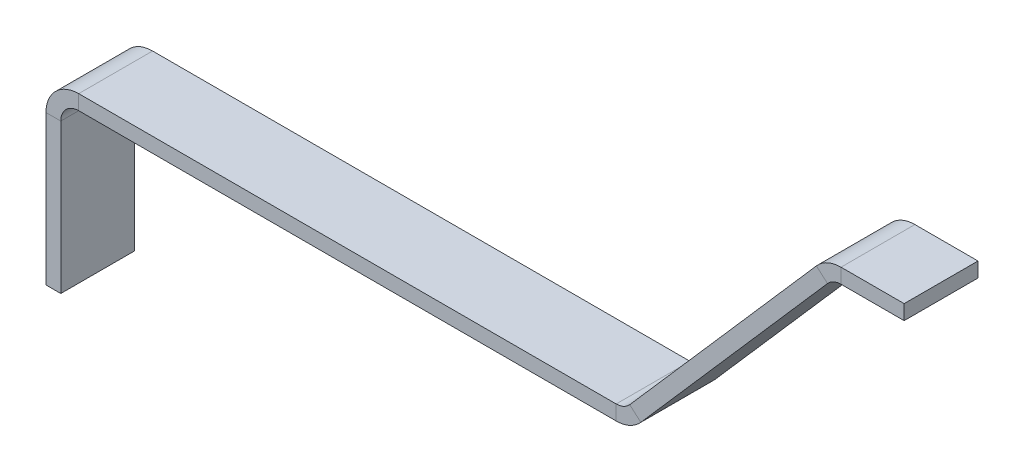
ISO-10303-21;
HEADER;
FILE_DESCRIPTION(('STEP AP214'),'2;1');
FILE_NAME('part.step','',(''),(''),'','','');
FILE_SCHEMA(('AUTOMOTIVE_DESIGN { 1 0 10303 214 1 1 1 1 }'));
ENDSEC;
DATA;
#1=APPLICATION_CONTEXT('core data for automotive mechanical design processes');
#2=APPLICATION_PROTOCOL_DEFINITION('international standard','automotive_design',2000,#1);
#3=PRODUCT_CONTEXT('',#1,'mechanical');
#4=PRODUCT('Part','Part','',(#3));
#5=PRODUCT_RELATED_PRODUCT_CATEGORY('part','',(#4));
#6=PRODUCT_DEFINITION_FORMATION('','',#4);
#7=PRODUCT_DEFINITION_CONTEXT('part definition',#1,'design');
#8=PRODUCT_DEFINITION('design','',#6,#7);
#9=PRODUCT_DEFINITION_SHAPE('','',#8);
#10=(LENGTH_UNIT() NAMED_UNIT(*) SI_UNIT(.MILLI.,.METRE.));
#11=(NAMED_UNIT(*) PLANE_ANGLE_UNIT() SI_UNIT($,.RADIAN.));
#12=(NAMED_UNIT(*) SI_UNIT($,.STERADIAN.) SOLID_ANGLE_UNIT());
#13=UNCERTAINTY_MEASURE_WITH_UNIT(LENGTH_MEASURE(1.E-05),#10,'distance_accuracy_value','');
#14=(GEOMETRIC_REPRESENTATION_CONTEXT(3) GLOBAL_UNCERTAINTY_ASSIGNED_CONTEXT((#13)) GLOBAL_UNIT_ASSIGNED_CONTEXT((#10,
#11,#12)) REPRESENTATION_CONTEXT('',''));
#15=CARTESIAN_POINT('',(0.,0.,0.));
#16=DIRECTION('',(0.,0.,1.));
#17=DIRECTION('',(1.,0.,0.));
#18=AXIS2_PLACEMENT_3D('',#15,#16,#17);
#19=CARTESIAN_POINT('',(-78.294437183355,-24.6505896738829,10.));
#20=DIRECTION('',(0.,-1.,0.));
#21=DIRECTION('',(0.,0.,-1.));
#22=AXIS2_PLACEMENT_3D('',#19,#20,#21);
#23=PLANE('',#22);
#24=DIRECTION('',(-1.,0.,0.));
#25=VECTOR('',#24,1.);
#26=CARTESIAN_POINT('',(-78.294437183355,-24.6505896738829,0.));
#27=LINE('',#26,#25);
#28=CARTESIAN_POINT('',(-76.294437183355,-24.6505896738829,0.));
#29=VERTEX_POINT('',#28);
#30=CARTESIAN_POINT('',(-78.294437183355,-24.6505896738829,0.));
#31=VERTEX_POINT('',#30);
#32=EDGE_CURVE('E11',#29,#31,#27,.T.);
#33=ORIENTED_EDGE('',*,*,#32,.F.);
#34=DIRECTION('',(0.,0.,-1.));
#35=VECTOR('',#34,1.);
#36=CARTESIAN_POINT('',(-76.294437183355,-24.6505896738829,10.));
#37=LINE('',#36,#35);
#38=CARTESIAN_POINT('',(-76.294437183355,-24.6505896738829,10.));
#39=VERTEX_POINT('',#38);
#40=EDGE_CURVE('E110',#39,#29,#37,.T.);
#41=ORIENTED_EDGE('',*,*,#40,.F.);
#42=DIRECTION('',(-1.,0.,0.));
#43=VECTOR('',#42,1.);
#44=CARTESIAN_POINT('',(-78.294437183355,-24.6505896738829,10.));
#45=LINE('',#44,#43);
#46=CARTESIAN_POINT('',(-78.294437183355,-24.6505896738829,10.));
#47=VERTEX_POINT('',#46);
#48=EDGE_CURVE('E47',#39,#47,#45,.T.);
#49=ORIENTED_EDGE('',*,*,#48,.T.);
#50=DIRECTION('',(0.,0.,-1.));
#51=VECTOR('',#50,1.);
#52=CARTESIAN_POINT('',(-78.294437183355,-24.6505896738829,10.));
#53=LINE('',#52,#51);
#54=EDGE_CURVE('E113',#47,#31,#53,.T.);
#55=ORIENTED_EDGE('',*,*,#54,.T.);
#56=EDGE_LOOP('',(#33,#41,#49,#55));
#57=FACE_BOUND('',#56,.T.);
#58=ADVANCED_FACE('F37',(#57),#23,.T.);
#59=CARTESIAN_POINT('',(-78.294437183355,-24.6505896738829,10.));
#60=DIRECTION('',(0.,0.,1.));
#61=DIRECTION('',(0.,-1.,0.));
#62=AXIS2_PLACEMENT_3D('',#59,#60,#61);
#63=PLANE('',#62);
#64=ORIENTED_EDGE('',*,*,#48,.F.);
#65=DIRECTION('',(0.,1.,0.));
#66=VECTOR('',#65,1.);
#67=CARTESIAN_POINT('',(-76.294437183355,-24.6505896738829,10.));
#68=LINE('',#67,#66);
#69=CARTESIAN_POINT('',(-76.294437183355,-4.43,10.));
#70=VERTEX_POINT('',#69);
#71=EDGE_CURVE('E126',#70,#39,#68,.F.);
#72=ORIENTED_EDGE('',*,*,#71,.F.);
#73=DIRECTION('',(-1.,0.,0.));
#74=VECTOR('',#73,1.);
#75=CARTESIAN_POINT('',(-78.294437183355,-4.43,10.));
#76=LINE('',#75,#74);
#77=CARTESIAN_POINT('',(-78.294437183355,-4.43,10.));
#78=VERTEX_POINT('',#77);
#79=EDGE_CURVE('E171',#70,#78,#76,.T.);
#80=ORIENTED_EDGE('',*,*,#79,.T.);
#81=DIRECTION('',(0.,-1.,0.));
#82=VECTOR('',#81,1.);
#83=CARTESIAN_POINT('',(-78.294437183355,-24.6505896738829,10.));
#84=LINE('',#83,#82);
#85=EDGE_CURVE('E183',#78,#47,#84,.T.);
#86=ORIENTED_EDGE('',*,*,#85,.T.);
#87=EDGE_LOOP('',(#64,#72,#80,#86));
#88=FACE_BOUND('',#87,.T.);
#89=ADVANCED_FACE('F187',(#88),#63,.T.);
#90=CARTESIAN_POINT('',(-73.8644371833551,-4.43,10.));
#91=DIRECTION('',(0.,0.,-1.));
#92=DIRECTION('',(-1.,0.,0.));
#93=AXIS2_PLACEMENT_3D('',#90,#91,#92);
#94=PLANE('',#93);
#95=ORIENTED_EDGE('',*,*,#79,.F.);
#96=CARTESIAN_POINT('',(-73.8644371833551,-4.43,10.));
#97=DIRECTION('',(0.,0.,-1.));
#98=DIRECTION('',(-1.,0.,0.));
#99=AXIS2_PLACEMENT_3D('',#96,#97,#98);
#100=CIRCLE('',#99,2.43);
#101=CARTESIAN_POINT('',(-73.8644371833551,-2.,10.));
#102=VERTEX_POINT('',#101);
#103=EDGE_CURVE('E222',#102,#70,#100,.F.);
#104=ORIENTED_EDGE('',*,*,#103,.F.);
#105=DIRECTION('',(0.,1.,0.));
#106=VECTOR('',#105,1.);
#107=CARTESIAN_POINT('',(-73.8644371833551,0.,10.));
#108=LINE('',#107,#106);
#109=CARTESIAN_POINT('',(-73.8644371833551,0.,10.));
#110=VERTEX_POINT('',#109);
#111=EDGE_CURVE('E168',#102,#110,#108,.T.);
#112=ORIENTED_EDGE('',*,*,#111,.T.);
#113=CARTESIAN_POINT('',(-73.8644371833551,-4.43,10.));
#114=DIRECTION('',(0.,0.,1.));
#115=DIRECTION('',(1.,0.,0.));
#116=AXIS2_PLACEMENT_3D('',#113,#114,#115);
#117=CIRCLE('',#116,4.43);
#118=EDGE_CURVE('E196',#110,#78,#117,.T.);
#119=ORIENTED_EDGE('',*,*,#118,.T.);
#120=EDGE_LOOP('',(#95,#104,#112,#119));
#121=FACE_BOUND('',#120,.T.);
#122=ADVANCED_FACE('F265',(#121),#94,.F.);
#123=CARTESIAN_POINT('',(-73.8644371833551,0.,10.));
#124=DIRECTION('',(0.,0.,1.));
#125=DIRECTION('',(-1.,0.,0.));
#126=AXIS2_PLACEMENT_3D('',#123,#124,#125);
#127=PLANE('',#126);
#128=ORIENTED_EDGE('',*,*,#111,.F.);
#129=DIRECTION('',(1.,0.,0.));
#130=VECTOR('',#129,1.);
#131=CARTESIAN_POINT('',(-73.8644371833551,-2.,10.));
#132=LINE('',#131,#130);
#133=CARTESIAN_POINT('',(-1.10327028692001,-2.,10.));
#134=VERTEX_POINT('',#133);
#135=EDGE_CURVE('E217',#134,#102,#132,.F.);
#136=ORIENTED_EDGE('',*,*,#135,.F.);
#137=DIRECTION('',(0.,1.,0.));
#138=VECTOR('',#137,1.);
#139=CARTESIAN_POINT('',(-1.10327028692001,0.,10.));
#140=LINE('',#139,#138);
#141=CARTESIAN_POINT('',(-1.10327028692001,0.,10.));
#142=VERTEX_POINT('',#141);
#143=EDGE_CURVE('E165',#134,#142,#140,.T.);
#144=ORIENTED_EDGE('',*,*,#143,.T.);
#145=DIRECTION('',(-1.,0.,0.));
#146=VECTOR('',#145,1.);
#147=CARTESIAN_POINT('',(-73.8644371833551,0.,10.));
#148=LINE('',#147,#146);
#149=EDGE_CURVE('E285',#142,#110,#148,.T.);
#150=ORIENTED_EDGE('',*,*,#149,.T.);
#151=EDGE_LOOP('',(#128,#136,#144,#150));
#152=FACE_BOUND('',#151,.T.);
#153=ADVANCED_FACE('F284',(#152),#127,.T.);
#154=CARTESIAN_POINT('',(-1.10327028692001,2.43,10.));
#155=DIRECTION('',(0.,0.,1.));
#156=DIRECTION('',(1.,0.,0.));
#157=AXIS2_PLACEMENT_3D('',#154,#155,#156);
#158=PLANE('',#157);
#159=ORIENTED_EDGE('',*,*,#143,.F.);
#160=CARTESIAN_POINT('',(-1.10327028692001,2.43,10.));
#161=DIRECTION('',(0.,0.,1.));
#162=DIRECTION('',(1.,0.,0.));
#163=AXIS2_PLACEMENT_3D('',#160,#161,#162);
#164=CIRCLE('',#163,4.43);
#165=CARTESIAN_POINT('',(2.23186553824323,-0.485779317388882,10.));
#166=VERTEX_POINT('',#165);
#167=EDGE_CURVE('E237',#134,#166,#164,.T.);
#168=ORIENTED_EDGE('',*,*,#167,.T.);
#169=DIRECTION('',(-0.752852330736621,0.658189462164534,0.));
#170=VECTOR('',#169,1.);
#171=CARTESIAN_POINT('',(0.726160876769985,0.830599606940182,10.));
#172=LINE('',#171,#170);
#173=CARTESIAN_POINT('',(0.726160876769985,0.830599606940182,10.));
#174=VERTEX_POINT('',#173);
#175=EDGE_CURVE('E55',#166,#174,#172,.T.);
#176=ORIENTED_EDGE('',*,*,#175,.T.);
#177=CARTESIAN_POINT('',(-1.10327028692001,2.43,10.));
#178=DIRECTION('',(0.,0.,-1.));
#179=DIRECTION('',(-1.,0.,0.));
#180=AXIS2_PLACEMENT_3D('',#177,#178,#179);
#181=CIRCLE('',#180,2.43);
#182=EDGE_CURVE('E207',#142,#174,#181,.F.);
#183=ORIENTED_EDGE('',*,*,#182,.F.);
#184=EDGE_LOOP('',(#159,#168,#176,#183));
#185=FACE_BOUND('',#184,.T.);
#186=ADVANCED_FACE('F294',(#185),#158,.T.);
#187=CARTESIAN_POINT('',(0.,0.,10.));
#188=DIRECTION('',(0.,0.,1.));
#189=DIRECTION('',(-0.658189462164534,-0.752852330736621,0.));
#190=AXIS2_PLACEMENT_3D('',#187,#188,#189);
#191=PLANE('',#190);
#192=ORIENTED_EDGE('',*,*,#175,.F.);
#193=DIRECTION('',(0.658189462164534,0.752852330736621,0.));
#194=VECTOR('',#193,1.);
#195=CARTESIAN_POINT('',(1.50570466147324,-1.31637892432907,10.));
#196=LINE('',#195,#194);
#197=CARTESIAN_POINT('',(27.5050899171433,28.4223192965147,10.));
#198=VERTEX_POINT('',#197);
#199=EDGE_CURVE('E229',#198,#166,#196,.F.);
#200=ORIENTED_EDGE('',*,*,#199,.F.);
#201=DIRECTION('',(-0.752852330736625,0.658189462164529,0.));
#202=VECTOR('',#201,1.);
#203=CARTESIAN_POINT('',(25.9993852556701,29.7386982208438,10.));
#204=LINE('',#203,#202);
#205=CARTESIAN_POINT('',(25.9993852556701,29.7386982208438,10.));
#206=VERTEX_POINT('',#205);
#207=EDGE_CURVE('E161',#198,#206,#204,.T.);
#208=ORIENTED_EDGE('',*,*,#207,.T.);
#209=DIRECTION('',(-0.658189462164534,-0.752852330736621,0.));
#210=VECTOR('',#209,1.);
#211=CARTESIAN_POINT('',(0.,0.,10.));
#212=LINE('',#211,#210);
#213=EDGE_CURVE('E309',#206,#174,#212,.T.);
#214=ORIENTED_EDGE('',*,*,#213,.T.);
#215=EDGE_LOOP('',(#192,#200,#208,#214));
#216=FACE_BOUND('',#215,.T.);
#217=ADVANCED_FACE('F416',(#216),#191,.T.);
#218=CARTESIAN_POINT('',(29.3345210808333,26.8229189034549,10.));
#219=DIRECTION('',(0.,0.,-1.));
#220=DIRECTION('',(-1.,0.,0.));
#221=AXIS2_PLACEMENT_3D('',#218,#219,#220);
#222=PLANE('',#221);
#223=ORIENTED_EDGE('',*,*,#207,.F.);
#224=CARTESIAN_POINT('',(29.3345210808333,26.8229189034549,10.));
#225=DIRECTION('',(0.,0.,-1.));
#226=DIRECTION('',(-1.,0.,0.));
#227=AXIS2_PLACEMENT_3D('',#224,#225,#226);
#228=CIRCLE('',#227,2.43);
#229=CARTESIAN_POINT('',(29.3345210808333,29.2529189034549,10.));
#230=VERTEX_POINT('',#229);
#231=EDGE_CURVE('E131',#230,#198,#228,.F.);
#232=ORIENTED_EDGE('',*,*,#231,.F.);
#233=DIRECTION('',(0.,1.,0.));
#234=VECTOR('',#233,1.);
#235=CARTESIAN_POINT('',(29.3345210808333,31.2529189034549,10.));
#236=LINE('',#235,#234);
#237=CARTESIAN_POINT('',(29.3345210808333,31.2529189034549,10.));
#238=VERTEX_POINT('',#237);
#239=EDGE_CURVE('E158',#230,#238,#236,.T.);
#240=ORIENTED_EDGE('',*,*,#239,.T.);
#241=CARTESIAN_POINT('',(29.3345210808333,26.8229189034549,10.));
#242=DIRECTION('',(0.,0.,1.));
#243=DIRECTION('',(1.,0.,0.));
#244=AXIS2_PLACEMENT_3D('',#241,#242,#243);
#245=CIRCLE('',#244,4.43);
#246=EDGE_CURVE('E329',#238,#206,#245,.T.);
#247=ORIENTED_EDGE('',*,*,#246,.T.);
#248=EDGE_LOOP('',(#223,#232,#240,#247));
#249=FACE_BOUND('',#248,.T.);
#250=ADVANCED_FACE('F335',(#249),#222,.F.);
#251=CARTESIAN_POINT('',(29.3345210808333,31.2529189034549,10.));
#252=DIRECTION('',(0.,0.,1.));
#253=DIRECTION('',(-1.,0.,0.));
#254=AXIS2_PLACEMENT_3D('',#251,#252,#253);
#255=PLANE('',#254);
#256=ORIENTED_EDGE('',*,*,#239,.F.);
#257=DIRECTION('',(1.,0.,0.));
#258=VECTOR('',#257,1.);
#259=CARTESIAN_POINT('',(29.3345210808333,29.2529189034549,10.));
#260=LINE('',#259,#258);
#261=CARTESIAN_POINT('',(37.877386656703,29.2529189034549,10.));
#262=VERTEX_POINT('',#261);
#263=EDGE_CURVE('E233',#262,#230,#260,.F.);
#264=ORIENTED_EDGE('',*,*,#263,.F.);
#265=DIRECTION('',(0.,1.,0.));
#266=VECTOR('',#265,1.);
#267=CARTESIAN_POINT('',(37.877386656703,31.2529189034549,10.));
#268=LINE('',#267,#266);
#269=CARTESIAN_POINT('',(37.877386656703,31.2529189034549,10.));
#270=VERTEX_POINT('',#269);
#271=EDGE_CURVE('E155',#262,#270,#268,.T.);
#272=ORIENTED_EDGE('',*,*,#271,.T.);
#273=DIRECTION('',(-1.,0.,0.));
#274=VECTOR('',#273,1.);
#275=CARTESIAN_POINT('',(29.3345210808333,31.2529189034549,10.));
#276=LINE('',#275,#274);
#277=EDGE_CURVE('E320',#270,#238,#276,.T.);
#278=ORIENTED_EDGE('',*,*,#277,.T.);
#279=EDGE_LOOP('',(#256,#264,#272,#278));
#280=FACE_BOUND('',#279,.T.);
#281=ADVANCED_FACE('F422',(#280),#255,.T.);
#282=CARTESIAN_POINT('',(37.877386656703,31.2529189034549,10.));
#283=DIRECTION('',(-1.,0.,0.));
#284=DIRECTION('',(0.,0.,-1.));
#285=AXIS2_PLACEMENT_3D('',#282,#283,#284);
#286=PLANE('',#285);
#287=ORIENTED_EDGE('',*,*,#271,.F.);
#288=DIRECTION('',(0.,0.,-1.));
#289=VECTOR('',#288,1.);
#290=CARTESIAN_POINT('',(37.877386656703,29.2529189034549,10.));
#291=LINE('',#290,#289);
#292=CARTESIAN_POINT('',(37.877386656703,29.2529189034549,0.));
#293=VERTEX_POINT('',#292);
#294=EDGE_CURVE('E246',#262,#293,#291,.T.);
#295=ORIENTED_EDGE('',*,*,#294,.T.);
#296=DIRECTION('',(0.,1.,0.));
#297=VECTOR('',#296,1.);
#298=CARTESIAN_POINT('',(37.877386656703,31.2529189034549,0.));
#299=LINE('',#298,#297);
#300=CARTESIAN_POINT('',(37.877386656703,31.2529189034549,0.));
#301=VERTEX_POINT('',#300);
#302=EDGE_CURVE('E152',#293,#301,#299,.T.);
#303=ORIENTED_EDGE('',*,*,#302,.T.);
#304=DIRECTION('',(0.,0.,-1.));
#305=VECTOR('',#304,1.);
#306=CARTESIAN_POINT('',(37.877386656703,31.2529189034549,10.));
#307=LINE('',#306,#305);
#308=EDGE_CURVE('E323',#270,#301,#307,.T.);
#309=ORIENTED_EDGE('',*,*,#308,.F.);
#310=EDGE_LOOP('',(#287,#295,#303,#309));
#311=FACE_BOUND('',#310,.T.);
#312=ADVANCED_FACE('F361',(#311),#286,.F.);
#313=CARTESIAN_POINT('',(29.3345210808333,31.2529189034549,0.));
#314=DIRECTION('',(0.,0.,1.));
#315=DIRECTION('',(-1.,0.,0.));
#316=AXIS2_PLACEMENT_3D('',#313,#314,#315);
#317=PLANE('',#316);
#318=ORIENTED_EDGE('',*,*,#302,.F.);
#319=DIRECTION('',(1.,0.,0.));
#320=VECTOR('',#319,1.);
#321=CARTESIAN_POINT('',(29.3345210808333,29.2529189034549,0.));
#322=LINE('',#321,#320);
#323=CARTESIAN_POINT('',(29.3345210808333,29.2529189034549,0.));
#324=VERTEX_POINT('',#323);
#325=EDGE_CURVE('E228',#293,#324,#322,.F.);
#326=ORIENTED_EDGE('',*,*,#325,.T.);
#327=DIRECTION('',(0.,1.,0.));
#328=VECTOR('',#327,1.);
#329=CARTESIAN_POINT('',(29.3345210808333,31.2529189034549,0.));
#330=LINE('',#329,#328);
#331=CARTESIAN_POINT('',(29.3345210808333,31.2529189034549,0.));
#332=VERTEX_POINT('',#331);
#333=EDGE_CURVE('E149',#324,#332,#330,.T.);
#334=ORIENTED_EDGE('',*,*,#333,.T.);
#335=DIRECTION('',(-1.,0.,0.));
#336=VECTOR('',#335,1.);
#337=CARTESIAN_POINT('',(29.3345210808333,31.2529189034549,0.));
#338=LINE('',#337,#336);
#339=EDGE_CURVE('E314',#301,#332,#338,.T.);
#340=ORIENTED_EDGE('',*,*,#339,.F.);
#341=EDGE_LOOP('',(#318,#326,#334,#340));
#342=FACE_BOUND('',#341,.T.);
#343=ADVANCED_FACE('F370',(#342),#317,.F.);
#344=CARTESIAN_POINT('',(29.3345210808333,26.8229189034549,0.));
#345=DIRECTION('',(0.,0.,-1.));
#346=DIRECTION('',(-1.,0.,0.));
#347=AXIS2_PLACEMENT_3D('',#344,#345,#346);
#348=PLANE('',#347);
#349=ORIENTED_EDGE('',*,*,#333,.F.);
#350=CARTESIAN_POINT('',(29.3345210808333,26.8229189034549,0.));
#351=DIRECTION('',(0.,0.,-1.));
#352=DIRECTION('',(-1.,0.,0.));
#353=AXIS2_PLACEMENT_3D('',#350,#351,#352);
#354=CIRCLE('',#353,2.43);
#355=CARTESIAN_POINT('',(27.5050899171433,28.4223192965147,0.));
#356=VERTEX_POINT('',#355);
#357=EDGE_CURVE('E134',#324,#356,#354,.F.);
#358=ORIENTED_EDGE('',*,*,#357,.T.);
#359=DIRECTION('',(-0.752852330736621,0.658189462164534,0.));
#360=VECTOR('',#359,1.);
#361=CARTESIAN_POINT('',(25.9993852556701,29.7386982208438,0.));
#362=LINE('',#361,#360);
#363=CARTESIAN_POINT('',(25.9993852556701,29.7386982208438,0.));
#364=VERTEX_POINT('',#363);
#365=EDGE_CURVE('E146',#356,#364,#362,.T.);
#366=ORIENTED_EDGE('',*,*,#365,.T.);
#367=CARTESIAN_POINT('',(29.3345210808333,26.8229189034549,0.));
#368=DIRECTION('',(0.,0.,1.));
#369=DIRECTION('',(1.,0.,0.));
#370=AXIS2_PLACEMENT_3D('',#367,#368,#369);
#371=CIRCLE('',#370,4.43);
#372=EDGE_CURVE('E326',#332,#364,#371,.T.);
#373=ORIENTED_EDGE('',*,*,#372,.F.);
#374=EDGE_LOOP('',(#349,#358,#366,#373));
#375=FACE_BOUND('',#374,.T.);
#376=ADVANCED_FACE('F371',(#375),#348,.T.);
#377=CARTESIAN_POINT('',(0.,0.,0.));
#378=DIRECTION('',(0.,0.,1.));
#379=DIRECTION('',(-0.658189462164534,-0.752852330736621,0.));
#380=AXIS2_PLACEMENT_3D('',#377,#378,#379);
#381=PLANE('',#380);
#382=ORIENTED_EDGE('',*,*,#365,.F.);
#383=DIRECTION('',(0.658189462164534,0.752852330736621,0.));
#384=VECTOR('',#383,1.);
#385=CARTESIAN_POINT('',(1.50570466147324,-1.31637892432907,0.));
#386=LINE('',#385,#384);
#387=CARTESIAN_POINT('',(2.23186553824323,-0.485779317388886,0.));
#388=VERTEX_POINT('',#387);
#389=EDGE_CURVE('E241',#356,#388,#386,.F.);
#390=ORIENTED_EDGE('',*,*,#389,.T.);
#391=DIRECTION('',(-0.752852330736621,0.658189462164534,0.));
#392=VECTOR('',#391,1.);
#393=CARTESIAN_POINT('',(0.726160876769985,0.830599606940182,0.));
#394=LINE('',#393,#392);
#395=CARTESIAN_POINT('',(0.726160876769985,0.830599606940182,0.));
#396=VERTEX_POINT('',#395);
#397=EDGE_CURVE('E144',#388,#396,#394,.T.);
#398=ORIENTED_EDGE('',*,*,#397,.T.);
#399=DIRECTION('',(-0.658189462164534,-0.752852330736621,0.));
#400=VECTOR('',#399,1.);
#401=CARTESIAN_POINT('',(0.,0.,0.));
#402=LINE('',#401,#400);
#403=EDGE_CURVE('E292',#364,#396,#402,.T.);
#404=ORIENTED_EDGE('',*,*,#403,.F.);
#405=EDGE_LOOP('',(#382,#390,#398,#404));
#406=FACE_BOUND('',#405,.T.);
#407=ADVANCED_FACE('F386',(#406),#381,.F.);
#408=CARTESIAN_POINT('',(-1.10327028692001,2.43,0.));
#409=DIRECTION('',(0.,0.,-1.));
#410=DIRECTION('',(-1.,0.,0.));
#411=AXIS2_PLACEMENT_3D('',#408,#409,#410);
#412=PLANE('',#411);
#413=ORIENTED_EDGE('',*,*,#397,.F.);
#414=CARTESIAN_POINT('',(-1.10327028692001,2.43,0.));
#415=DIRECTION('',(0.,0.,1.));
#416=DIRECTION('',(1.,0.,0.));
#417=AXIS2_PLACEMENT_3D('',#414,#415,#416);
#418=CIRCLE('',#417,4.43);
#419=CARTESIAN_POINT('',(-1.10327028692001,-2.,0.));
#420=VERTEX_POINT('',#419);
#421=EDGE_CURVE('E238',#388,#420,#418,.F.);
#422=ORIENTED_EDGE('',*,*,#421,.T.);
#423=DIRECTION('',(0.,1.,0.));
#424=VECTOR('',#423,1.);
#425=CARTESIAN_POINT('',(-1.10327028692001,0.,0.));
#426=LINE('',#425,#424);
#427=CARTESIAN_POINT('',(-1.10327028692001,0.,0.));
#428=VERTEX_POINT('',#427);
#429=EDGE_CURVE('E141',#420,#428,#426,.T.);
#430=ORIENTED_EDGE('',*,*,#429,.T.);
#431=CARTESIAN_POINT('',(-1.10327028692001,2.43,0.));
#432=DIRECTION('',(0.,0.,1.));
#433=DIRECTION('',(1.,0.,0.));
#434=AXIS2_PLACEMENT_3D('',#431,#432,#433);
#435=CIRCLE('',#434,2.43);
#436=EDGE_CURVE('E204',#396,#428,#435,.F.);
#437=ORIENTED_EDGE('',*,*,#436,.F.);
#438=EDGE_LOOP('',(#413,#422,#430,#437));
#439=FACE_BOUND('',#438,.T.);
#440=ADVANCED_FACE('F387',(#439),#412,.T.);
#441=CARTESIAN_POINT('',(-73.8644371833551,0.,0.));
#442=DIRECTION('',(0.,0.,1.));
#443=DIRECTION('',(-1.,0.,0.));
#444=AXIS2_PLACEMENT_3D('',#441,#442,#443);
#445=PLANE('',#444);
#446=ORIENTED_EDGE('',*,*,#429,.F.);
#447=DIRECTION('',(1.,0.,0.));
#448=VECTOR('',#447,1.);
#449=CARTESIAN_POINT('',(-73.8644371833551,-2.,0.));
#450=LINE('',#449,#448);
#451=CARTESIAN_POINT('',(-73.8644371833551,-2.,0.));
#452=VERTEX_POINT('',#451);
#453=EDGE_CURVE('E218',#420,#452,#450,.F.);
#454=ORIENTED_EDGE('',*,*,#453,.T.);
#455=DIRECTION('',(0.,1.,0.));
#456=VECTOR('',#455,1.);
#457=CARTESIAN_POINT('',(-73.8644371833551,0.,0.));
#458=LINE('',#457,#456);
#459=CARTESIAN_POINT('',(-73.8644371833551,0.,0.));
#460=VERTEX_POINT('',#459);
#461=EDGE_CURVE('E138',#452,#460,#458,.T.);
#462=ORIENTED_EDGE('',*,*,#461,.T.);
#463=DIRECTION('',(-1.,0.,0.));
#464=VECTOR('',#463,1.);
#465=CARTESIAN_POINT('',(-73.8644371833551,0.,0.));
#466=LINE('',#465,#464);
#467=EDGE_CURVE('E210',#428,#460,#466,.T.);
#468=ORIENTED_EDGE('',*,*,#467,.F.);
#469=EDGE_LOOP('',(#446,#454,#462,#468));
#470=FACE_BOUND('',#469,.T.);
#471=ADVANCED_FACE('F303',(#470),#445,.F.);
#472=CARTESIAN_POINT('',(-73.8644371833551,-4.43,0.));
#473=DIRECTION('',(0.,0.,-1.));
#474=DIRECTION('',(-1.,0.,0.));
#475=AXIS2_PLACEMENT_3D('',#472,#473,#474);
#476=PLANE('',#475);
#477=ORIENTED_EDGE('',*,*,#461,.F.);
#478=CARTESIAN_POINT('',(-73.8644371833551,-4.43,0.));
#479=DIRECTION('',(0.,0.,-1.));
#480=DIRECTION('',(-1.,0.,0.));
#481=AXIS2_PLACEMENT_3D('',#478,#479,#480);
#482=CIRCLE('',#481,2.43);
#483=CARTESIAN_POINT('',(-76.294437183355,-4.43,0.));
#484=VERTEX_POINT('',#483);
#485=EDGE_CURVE('E213',#452,#484,#482,.F.);
#486=ORIENTED_EDGE('',*,*,#485,.T.);
#487=DIRECTION('',(-1.,0.,0.));
#488=VECTOR('',#487,1.);
#489=CARTESIAN_POINT('',(-78.294437183355,-4.43,0.));
#490=LINE('',#489,#488);
#491=CARTESIAN_POINT('',(-78.294437183355,-4.43,0.));
#492=VERTEX_POINT('',#491);
#493=EDGE_CURVE('E41',#484,#492,#490,.T.);
#494=ORIENTED_EDGE('',*,*,#493,.T.);
#495=CARTESIAN_POINT('',(-73.8644371833551,-4.43,0.));
#496=DIRECTION('',(0.,0.,1.));
#497=DIRECTION('',(1.,0.,0.));
#498=AXIS2_PLACEMENT_3D('',#495,#496,#497);
#499=CIRCLE('',#498,4.43);
#500=EDGE_CURVE('E190',#460,#492,#499,.T.);
#501=ORIENTED_EDGE('',*,*,#500,.F.);
#502=EDGE_LOOP('',(#477,#486,#494,#501));
#503=FACE_BOUND('',#502,.T.);
#504=ADVANCED_FACE('F394',(#503),#476,.T.);
#505=CARTESIAN_POINT('',(-78.294437183355,-24.6505896738829,0.));
#506=DIRECTION('',(0.,0.,1.));
#507=DIRECTION('',(0.,-1.,0.));
#508=AXIS2_PLACEMENT_3D('',#505,#506,#507);
#509=PLANE('',#508);
#510=DIRECTION('',(0.,1.,0.));
#511=VECTOR('',#510,1.);
#512=CARTESIAN_POINT('',(-76.294437183355,-24.6505896738829,0.));
#513=LINE('',#512,#511);
#514=EDGE_CURVE('E123',#484,#29,#513,.F.);
#515=ORIENTED_EDGE('',*,*,#514,.T.);
#516=ORIENTED_EDGE('',*,*,#32,.T.);
#517=DIRECTION('',(0.,-1.,0.));
#518=VECTOR('',#517,1.);
#519=CARTESIAN_POINT('',(-78.294437183355,-24.6505896738829,0.));
#520=LINE('',#519,#518);
#521=EDGE_CURVE('E185',#492,#31,#520,.T.);
#522=ORIENTED_EDGE('',*,*,#521,.F.);
#523=ORIENTED_EDGE('',*,*,#493,.F.);
#524=EDGE_LOOP('',(#515,#516,#522,#523));
#525=FACE_BOUND('',#524,.T.);
#526=ADVANCED_FACE('F39',(#525),#509,.F.);
#527=CARTESIAN_POINT('',(-73.8644371833551,-4.43,10.));
#528=DIRECTION('',(0.,0.,-1.));
#529=DIRECTION('',(-1.,0.,0.));
#530=AXIS2_PLACEMENT_3D('',#527,#528,#529);
#531=CYLINDRICAL_SURFACE('',#530,4.43);
#532=ORIENTED_EDGE('',*,*,#500,.T.);
#533=DIRECTION('',(0.,0.,-1.));
#534=VECTOR('',#533,1.);
#535=CARTESIAN_POINT('',(-78.294437183355,-4.43,10.));
#536=LINE('',#535,#534);
#537=EDGE_CURVE('E188',#78,#492,#536,.T.);
#538=ORIENTED_EDGE('',*,*,#537,.F.);
#539=ORIENTED_EDGE('',*,*,#118,.F.);
#540=DIRECTION('',(0.,0.,-1.));
#541=VECTOR('',#540,1.);
#542=CARTESIAN_POINT('',(-73.8644371833551,0.,10.));
#543=LINE('',#542,#541);
#544=EDGE_CURVE('E291',#110,#460,#543,.T.);
#545=ORIENTED_EDGE('',*,*,#544,.T.);
#546=EDGE_LOOP('',(#532,#538,#539,#545));
#547=FACE_BOUND('',#546,.T.);
#548=ADVANCED_FACE('F275',(#547),#531,.T.);
#549=CARTESIAN_POINT('',(-78.294437183355,-24.6505896738829,10.));
#550=DIRECTION('',(1.,0.,0.));
#551=DIRECTION('',(0.,0.,-1.));
#552=AXIS2_PLACEMENT_3D('',#549,#550,#551);
#553=PLANE('',#552);
#554=ORIENTED_EDGE('',*,*,#521,.T.);
#555=ORIENTED_EDGE('',*,*,#54,.F.);
#556=ORIENTED_EDGE('',*,*,#85,.F.);
#557=ORIENTED_EDGE('',*,*,#537,.T.);
#558=EDGE_LOOP('',(#554,#555,#556,#557));
#559=FACE_BOUND('',#558,.T.);
#560=ADVANCED_FACE('F181',(#559),#553,.F.);
#561=CARTESIAN_POINT('',(29.3345210808333,26.8229189034549,10.));
#562=DIRECTION('',(0.,0.,-1.));
#563=DIRECTION('',(-1.,0.,0.));
#564=AXIS2_PLACEMENT_3D('',#561,#562,#563);
#565=CYLINDRICAL_SURFACE('',#564,4.43);
#566=ORIENTED_EDGE('',*,*,#372,.T.);
#567=DIRECTION('',(0.,0.,-1.));
#568=VECTOR('',#567,1.);
#569=CARTESIAN_POINT('',(25.9993852556701,29.7386982208438,10.));
#570=LINE('',#569,#568);
#571=EDGE_CURVE('E311',#206,#364,#570,.T.);
#572=ORIENTED_EDGE('',*,*,#571,.F.);
#573=ORIENTED_EDGE('',*,*,#246,.F.);
#574=DIRECTION('',(0.,0.,-1.));
#575=VECTOR('',#574,1.);
#576=CARTESIAN_POINT('',(29.3345210808333,31.2529189034549,10.));
#577=LINE('',#576,#575);
#578=EDGE_CURVE('E317',#238,#332,#577,.T.);
#579=ORIENTED_EDGE('',*,*,#578,.T.);
#580=EDGE_LOOP('',(#566,#572,#573,#579));
#581=FACE_BOUND('',#580,.T.);
#582=ADVANCED_FACE('F342',(#581),#565,.T.);
#583=CARTESIAN_POINT('',(29.3345210808333,31.2529189034549,10.));
#584=DIRECTION('',(0.,-1.,0.));
#585=DIRECTION('',(0.,0.,-1.));
#586=AXIS2_PLACEMENT_3D('',#583,#584,#585);
#587=PLANE('',#586);
#588=ORIENTED_EDGE('',*,*,#339,.T.);
#589=ORIENTED_EDGE('',*,*,#578,.F.);
#590=ORIENTED_EDGE('',*,*,#277,.F.);
#591=ORIENTED_EDGE('',*,*,#308,.T.);
#592=EDGE_LOOP('',(#588,#589,#590,#591));
#593=FACE_BOUND('',#592,.T.);
#594=ADVANCED_FACE('F368',(#593),#587,.F.);
#595=CARTESIAN_POINT('',(0.,0.,10.));
#596=DIRECTION('',(0.752852330736621,-0.658189462164534,0.));
#597=DIRECTION('',(0.658189462164534,0.752852330736621,0.));
#598=AXIS2_PLACEMENT_3D('',#595,#596,#597);
#599=PLANE('',#598);
#600=ORIENTED_EDGE('',*,*,#403,.T.);
#601=DIRECTION('',(0.,0.,-1.));
#602=VECTOR('',#601,1.);
#603=CARTESIAN_POINT('',(0.726160876769985,0.830599606940182,10.));
#604=LINE('',#603,#602);
#605=EDGE_CURVE('E201',#396,#174,#604,.F.);
#606=ORIENTED_EDGE('',*,*,#605,.T.);
#607=ORIENTED_EDGE('',*,*,#213,.F.);
#608=ORIENTED_EDGE('',*,*,#571,.T.);
#609=EDGE_LOOP('',(#600,#606,#607,#608));
#610=FACE_BOUND('',#609,.T.);
#611=ADVANCED_FACE('F347',(#610),#599,.F.);
#612=CARTESIAN_POINT('',(-73.8644371833551,0.,10.));
#613=DIRECTION('',(0.,-1.,0.));
#614=DIRECTION('',(0.,0.,-1.));
#615=AXIS2_PLACEMENT_3D('',#612,#613,#614);
#616=PLANE('',#615);
#617=ORIENTED_EDGE('',*,*,#149,.F.);
#618=DIRECTION('',(0.,0.,-1.));
#619=VECTOR('',#618,1.);
#620=CARTESIAN_POINT('',(-1.10327028692001,0.,0.));
#621=LINE('',#620,#619);
#622=EDGE_CURVE('E198',#142,#428,#621,.T.);
#623=ORIENTED_EDGE('',*,*,#622,.T.);
#624=ORIENTED_EDGE('',*,*,#467,.T.);
#625=ORIENTED_EDGE('',*,*,#544,.F.);
#626=EDGE_LOOP('',(#617,#623,#624,#625));
#627=FACE_BOUND('',#626,.T.);
#628=ADVANCED_FACE('F288',(#627),#616,.F.);
#629=CARTESIAN_POINT('',(-1.10327028692001,2.43,10.));
#630=DIRECTION('',(0.,0.,1.));
#631=DIRECTION('',(1.,0.,0.));
#632=AXIS2_PLACEMENT_3D('',#629,#630,#631);
#633=CYLINDRICAL_SURFACE('',#632,2.43);
#634=ORIENTED_EDGE('',*,*,#182,.T.);
#635=ORIENTED_EDGE('',*,*,#605,.F.);
#636=ORIENTED_EDGE('',*,*,#436,.T.);
#637=ORIENTED_EDGE('',*,*,#622,.F.);
#638=EDGE_LOOP('',(#634,#635,#636,#637));
#639=FACE_BOUND('',#638,.T.);
#640=ADVANCED_FACE('F298',(#639),#633,.F.);
#641=CARTESIAN_POINT('',(-73.8644371833551,-4.43,10.));
#642=DIRECTION('',(0.,0.,-1.));
#643=DIRECTION('',(-1.,0.,0.));
#644=AXIS2_PLACEMENT_3D('',#641,#642,#643);
#645=CYLINDRICAL_SURFACE('',#644,2.43);
#646=ORIENTED_EDGE('',*,*,#485,.F.);
#647=DIRECTION('',(0.,0.,-1.));
#648=VECTOR('',#647,1.);
#649=CARTESIAN_POINT('',(-73.8644371833551,-2.,10.));
#650=LINE('',#649,#648);
#651=EDGE_CURVE('E214',#102,#452,#650,.T.);
#652=ORIENTED_EDGE('',*,*,#651,.F.);
#653=ORIENTED_EDGE('',*,*,#103,.T.);
#654=DIRECTION('',(0.,0.,-1.));
#655=VECTOR('',#654,1.);
#656=CARTESIAN_POINT('',(-76.294437183355,-4.43,10.));
#657=LINE('',#656,#655);
#658=EDGE_CURVE('E211',#70,#484,#657,.T.);
#659=ORIENTED_EDGE('',*,*,#658,.T.);
#660=EDGE_LOOP('',(#646,#652,#653,#659));
#661=FACE_BOUND('',#660,.T.);
#662=ADVANCED_FACE('F263',(#661),#645,.F.);
#663=CARTESIAN_POINT('',(-76.294437183355,-24.6505896738829,10.));
#664=DIRECTION('',(1.,0.,0.));
#665=DIRECTION('',(0.,0.,-1.));
#666=AXIS2_PLACEMENT_3D('',#663,#664,#665);
#667=PLANE('',#666);
#668=ORIENTED_EDGE('',*,*,#514,.F.);
#669=ORIENTED_EDGE('',*,*,#658,.F.);
#670=ORIENTED_EDGE('',*,*,#71,.T.);
#671=ORIENTED_EDGE('',*,*,#40,.T.);
#672=EDGE_LOOP('',(#668,#669,#670,#671));
#673=FACE_BOUND('',#672,.T.);
#674=ADVANCED_FACE('F121',(#673),#667,.T.);
#675=CARTESIAN_POINT('',(29.3345210808333,26.8229189034549,10.));
#676=DIRECTION('',(0.,0.,-1.));
#677=DIRECTION('',(-1.,0.,0.));
#678=AXIS2_PLACEMENT_3D('',#675,#676,#677);
#679=CYLINDRICAL_SURFACE('',#678,2.43);
#680=ORIENTED_EDGE('',*,*,#357,.F.);
#681=DIRECTION('',(0.,0.,-1.));
#682=VECTOR('',#681,1.);
#683=CARTESIAN_POINT('',(29.3345210808333,29.2529189034549,10.));
#684=LINE('',#683,#682);
#685=EDGE_CURVE('E230',#230,#324,#684,.T.);
#686=ORIENTED_EDGE('',*,*,#685,.F.);
#687=ORIENTED_EDGE('',*,*,#231,.T.);
#688=DIRECTION('',(0.,0.,1.));
#689=VECTOR('',#688,1.);
#690=CARTESIAN_POINT('',(27.5050899171433,28.4223192965147,10.));
#691=LINE('',#690,#689);
#692=EDGE_CURVE('E225',#198,#356,#691,.F.);
#693=ORIENTED_EDGE('',*,*,#692,.T.);
#694=EDGE_LOOP('',(#680,#686,#687,#693));
#695=FACE_BOUND('',#694,.T.);
#696=ADVANCED_FACE('F378',(#695),#679,.F.);
#697=CARTESIAN_POINT('',(29.3345210808333,29.2529189034549,10.));
#698=DIRECTION('',(0.,-1.,0.));
#699=DIRECTION('',(0.,0.,-1.));
#700=AXIS2_PLACEMENT_3D('',#697,#698,#699);
#701=PLANE('',#700);
#702=ORIENTED_EDGE('',*,*,#325,.F.);
#703=ORIENTED_EDGE('',*,*,#294,.F.);
#704=ORIENTED_EDGE('',*,*,#263,.T.);
#705=ORIENTED_EDGE('',*,*,#685,.T.);
#706=EDGE_LOOP('',(#702,#703,#704,#705));
#707=FACE_BOUND('',#706,.T.);
#708=ADVANCED_FACE('F375',(#707),#701,.T.);
#709=CARTESIAN_POINT('',(1.50570466147324,-1.31637892432907,10.));
#710=DIRECTION('',(0.752852330736621,-0.658189462164534,0.));
#711=DIRECTION('',(0.658189462164534,0.752852330736621,0.));
#712=AXIS2_PLACEMENT_3D('',#709,#710,#711);
#713=PLANE('',#712);
#714=ORIENTED_EDGE('',*,*,#389,.F.);
#715=ORIENTED_EDGE('',*,*,#692,.F.);
#716=ORIENTED_EDGE('',*,*,#199,.T.);
#717=DIRECTION('',(0.,0.,1.));
#718=VECTOR('',#717,1.);
#719=CARTESIAN_POINT('',(2.23186553824323,-0.485779317388886,10.));
#720=LINE('',#719,#718);
#721=EDGE_CURVE('E208',#388,#166,#720,.T.);
#722=ORIENTED_EDGE('',*,*,#721,.F.);
#723=EDGE_LOOP('',(#714,#715,#716,#722));
#724=FACE_BOUND('',#723,.T.);
#725=ADVANCED_FACE('F383',(#724),#713,.T.);
#726=CARTESIAN_POINT('',(-73.8644371833551,-2.,10.));
#727=DIRECTION('',(0.,-1.,0.));
#728=DIRECTION('',(0.,0.,-1.));
#729=AXIS2_PLACEMENT_3D('',#726,#727,#728);
#730=PLANE('',#729);
#731=ORIENTED_EDGE('',*,*,#135,.T.);
#732=ORIENTED_EDGE('',*,*,#651,.T.);
#733=ORIENTED_EDGE('',*,*,#453,.F.);
#734=DIRECTION('',(0.,0.,-1.));
#735=VECTOR('',#734,1.);
#736=CARTESIAN_POINT('',(-1.10327028692001,-2.,10.));
#737=LINE('',#736,#735);
#738=EDGE_CURVE('E219',#134,#420,#737,.T.);
#739=ORIENTED_EDGE('',*,*,#738,.F.);
#740=EDGE_LOOP('',(#731,#732,#733,#739));
#741=FACE_BOUND('',#740,.T.);
#742=ADVANCED_FACE('F393',(#741),#730,.T.);
#743=CARTESIAN_POINT('',(-1.10327028692001,2.43,10.));
#744=DIRECTION('',(0.,0.,1.));
#745=DIRECTION('',(1.,0.,0.));
#746=AXIS2_PLACEMENT_3D('',#743,#744,#745);
#747=CYLINDRICAL_SURFACE('',#746,4.43);
#748=ORIENTED_EDGE('',*,*,#167,.F.);
#749=ORIENTED_EDGE('',*,*,#738,.T.);
#750=ORIENTED_EDGE('',*,*,#421,.F.);
#751=ORIENTED_EDGE('',*,*,#721,.T.);
#752=EDGE_LOOP('',(#748,#749,#750,#751));
#753=FACE_BOUND('',#752,.T.);
#754=ADVANCED_FACE('F390',(#753),#747,.T.);
#755=CLOSED_SHELL('',(#58,#89,#122,#153,#186,#217,#250,#281,#312,#343,#376,#407,#440,#471,#504,
#526,#548,#560,#582,#594,#611,#628,#640,#662,#674,#696,#708,#725,#742,#754));
#756=MANIFOLD_SOLID_BREP('B2',#755);
#757=ADVANCED_BREP_SHAPE_REPRESENTATION('',(#18,#756),#14);
#758=SHAPE_DEFINITION_REPRESENTATION(#9,#757);
ENDSEC;
END-ISO-10303-21;
